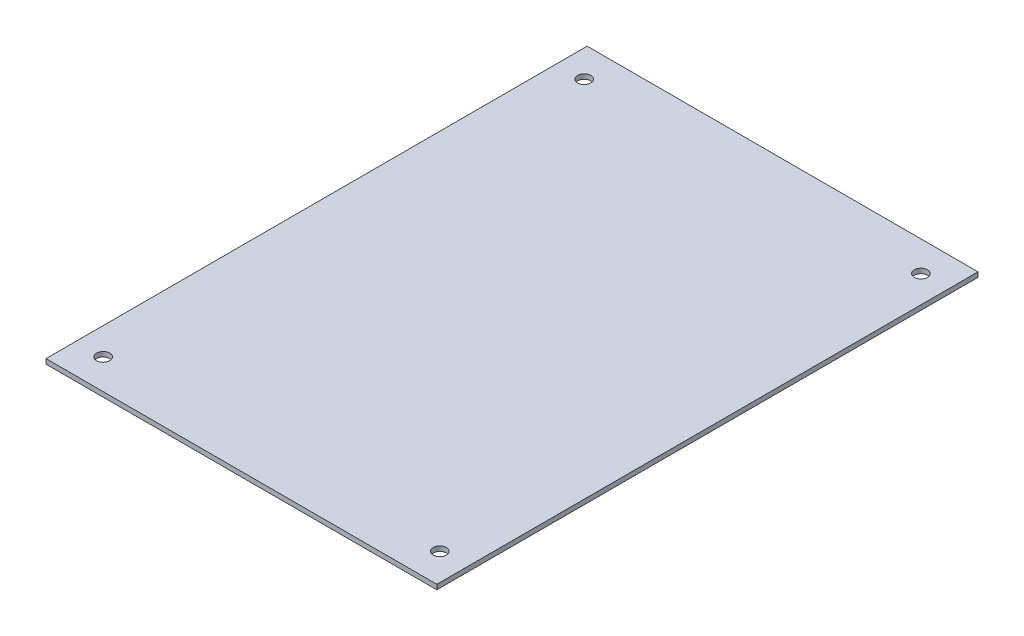
ISO-10303-21;
HEADER;
FILE_DESCRIPTION(('STEP AP214'),'2;1');
FILE_NAME('part.step','',(''),(''),'','','');
FILE_SCHEMA(('AUTOMOTIVE_DESIGN { 1 0 10303 214 1 1 1 1 }'));
ENDSEC;
DATA;
#1=APPLICATION_CONTEXT('core data for automotive mechanical design processes');
#2=APPLICATION_PROTOCOL_DEFINITION('international standard','automotive_design',2000,#1);
#3=PRODUCT_CONTEXT('',#1,'mechanical');
#4=PRODUCT('Part','Part','',(#3));
#5=PRODUCT_RELATED_PRODUCT_CATEGORY('part','',(#4));
#6=PRODUCT_DEFINITION_FORMATION('','',#4);
#7=PRODUCT_DEFINITION_CONTEXT('part definition',#1,'design');
#8=PRODUCT_DEFINITION('design','',#6,#7);
#9=PRODUCT_DEFINITION_SHAPE('','',#8);
#10=(LENGTH_UNIT() NAMED_UNIT(*) SI_UNIT(.MILLI.,.METRE.));
#11=(NAMED_UNIT(*) PLANE_ANGLE_UNIT() SI_UNIT($,.RADIAN.));
#12=(NAMED_UNIT(*) SI_UNIT($,.STERADIAN.) SOLID_ANGLE_UNIT());
#13=UNCERTAINTY_MEASURE_WITH_UNIT(LENGTH_MEASURE(1.E-05),#10,'distance_accuracy_value','');
#14=(GEOMETRIC_REPRESENTATION_CONTEXT(3) GLOBAL_UNCERTAINTY_ASSIGNED_CONTEXT((#13)) GLOBAL_UNIT_ASSIGNED_CONTEXT((#10,
#11,#12)) REPRESENTATION_CONTEXT('',''));
#15=CARTESIAN_POINT('',(0.,0.,0.));
#16=DIRECTION('',(0.,0.,1.));
#17=DIRECTION('',(1.,0.,0.));
#18=AXIS2_PLACEMENT_3D('',#15,#16,#17);
#19=CARTESIAN_POINT('',(0.,0.8,0.));
#20=DIRECTION('',(0.,0.,-1.));
#21=DIRECTION('',(-1.,0.,0.));
#22=AXIS2_PLACEMENT_3D('',#19,#20,#21);
#23=PLANE('',#22);
#24=DIRECTION('',(1.,0.,0.));
#25=VECTOR('',#24,1.);
#26=CARTESIAN_POINT('',(0.,0.,0.));
#27=LINE('',#26,#25);
#28=CARTESIAN_POINT('',(0.,0.,0.));
#29=VERTEX_POINT('',#28);
#30=CARTESIAN_POINT('',(65.,0.,0.));
#31=VERTEX_POINT('',#30);
#32=EDGE_CURVE('E127',#29,#31,#27,.T.);
#33=ORIENTED_EDGE('',*,*,#32,.T.);
#34=DIRECTION('',(0.,-1.,0.));
#35=VECTOR('',#34,1.);
#36=CARTESIAN_POINT('',(65.,0.8,0.));
#37=LINE('',#36,#35);
#38=CARTESIAN_POINT('',(65.,0.8,0.));
#39=VERTEX_POINT('',#38);
#40=EDGE_CURVE('E11',#39,#31,#37,.T.);
#41=ORIENTED_EDGE('',*,*,#40,.F.);
#42=DIRECTION('',(1.,0.,0.));
#43=VECTOR('',#42,1.);
#44=CARTESIAN_POINT('',(0.,0.8,0.));
#45=LINE('',#44,#43);
#46=CARTESIAN_POINT('',(0.,0.8,0.));
#47=VERTEX_POINT('',#46);
#48=EDGE_CURVE('E93',#47,#39,#45,.T.);
#49=ORIENTED_EDGE('',*,*,#48,.F.);
#50=DIRECTION('',(0.,-1.,0.));
#51=VECTOR('',#50,1.);
#52=CARTESIAN_POINT('',(0.,0.8,0.));
#53=LINE('',#52,#51);
#54=EDGE_CURVE('E59',#47,#29,#53,.T.);
#55=ORIENTED_EDGE('',*,*,#54,.T.);
#56=EDGE_LOOP('',(#33,#41,#49,#55));
#57=FACE_BOUND('',#56,.T.);
#58=ADVANCED_FACE('F41',(#57),#23,.F.);
#59=CARTESIAN_POINT('',(65.,0.8,0.));
#60=DIRECTION('',(-1.,0.,0.));
#61=DIRECTION('',(0.,0.,1.));
#62=AXIS2_PLACEMENT_3D('',#59,#60,#61);
#63=PLANE('',#62);
#64=DIRECTION('',(0.,0.,-1.));
#65=VECTOR('',#64,1.);
#66=CARTESIAN_POINT('',(65.,0.,0.));
#67=LINE('',#66,#65);
#68=CARTESIAN_POINT('',(65.,0.,-90.));
#69=VERTEX_POINT('',#68);
#70=EDGE_CURVE('E99',#31,#69,#67,.T.);
#71=ORIENTED_EDGE('',*,*,#70,.T.);
#72=DIRECTION('',(0.,-1.,0.));
#73=VECTOR('',#72,1.);
#74=CARTESIAN_POINT('',(65.,0.8,-90.));
#75=LINE('',#74,#73);
#76=CARTESIAN_POINT('',(65.,0.8,-90.));
#77=VERTEX_POINT('',#76);
#78=EDGE_CURVE('E51',#77,#69,#75,.T.);
#79=ORIENTED_EDGE('',*,*,#78,.F.);
#80=DIRECTION('',(0.,0.,-1.));
#81=VECTOR('',#80,1.);
#82=CARTESIAN_POINT('',(65.,0.8,0.));
#83=LINE('',#82,#81);
#84=EDGE_CURVE('E84',#39,#77,#83,.T.);
#85=ORIENTED_EDGE('',*,*,#84,.F.);
#86=ORIENTED_EDGE('',*,*,#40,.T.);
#87=EDGE_LOOP('',(#71,#79,#85,#86));
#88=FACE_BOUND('',#87,.T.);
#89=ADVANCED_FACE('F98',(#88),#63,.F.);
#90=CARTESIAN_POINT('',(0.,0.8,-90.));
#91=DIRECTION('',(0.,0.,-1.));
#92=DIRECTION('',(-1.,0.,0.));
#93=AXIS2_PLACEMENT_3D('',#90,#91,#92);
#94=PLANE('',#93);
#95=DIRECTION('',(1.,0.,0.));
#96=VECTOR('',#95,1.);
#97=CARTESIAN_POINT('',(0.,0.,-90.));
#98=LINE('',#97,#96);
#99=CARTESIAN_POINT('',(0.,0.,-90.));
#100=VERTEX_POINT('',#99);
#101=EDGE_CURVE('E132',#100,#69,#98,.T.);
#102=ORIENTED_EDGE('',*,*,#101,.F.);
#103=DIRECTION('',(0.,-1.,0.));
#104=VECTOR('',#103,1.);
#105=CARTESIAN_POINT('',(0.,0.8,-90.));
#106=LINE('',#105,#104);
#107=CARTESIAN_POINT('',(0.,0.8,-90.));
#108=VERTEX_POINT('',#107);
#109=EDGE_CURVE('E73',#108,#100,#106,.T.);
#110=ORIENTED_EDGE('',*,*,#109,.F.);
#111=DIRECTION('',(1.,0.,0.));
#112=VECTOR('',#111,1.);
#113=CARTESIAN_POINT('',(0.,0.8,-90.));
#114=LINE('',#113,#112);
#115=EDGE_CURVE('E92',#108,#77,#114,.T.);
#116=ORIENTED_EDGE('',*,*,#115,.T.);
#117=ORIENTED_EDGE('',*,*,#78,.T.);
#118=EDGE_LOOP('',(#102,#110,#116,#117));
#119=FACE_BOUND('',#118,.T.);
#120=ADVANCED_FACE('F103',(#119),#94,.T.);
#121=CARTESIAN_POINT('',(0.,0.8,0.));
#122=DIRECTION('',(-1.,0.,0.));
#123=DIRECTION('',(0.,0.,1.));
#124=AXIS2_PLACEMENT_3D('',#121,#122,#123);
#125=PLANE('',#124);
#126=DIRECTION('',(0.,0.,-1.));
#127=VECTOR('',#126,1.);
#128=CARTESIAN_POINT('',(0.,0.,0.));
#129=LINE('',#128,#127);
#130=EDGE_CURVE('E135',#29,#100,#129,.T.);
#131=ORIENTED_EDGE('',*,*,#130,.F.);
#132=ORIENTED_EDGE('',*,*,#54,.F.);
#133=DIRECTION('',(0.,0.,-1.));
#134=VECTOR('',#133,1.);
#135=CARTESIAN_POINT('',(0.,0.8,0.));
#136=LINE('',#135,#134);
#137=EDGE_CURVE('E105',#47,#108,#136,.T.);
#138=ORIENTED_EDGE('',*,*,#137,.T.);
#139=ORIENTED_EDGE('',*,*,#109,.T.);
#140=EDGE_LOOP('',(#131,#132,#138,#139));
#141=FACE_BOUND('',#140,.T.);
#142=ADVANCED_FACE('F192',(#141),#125,.T.);
#143=CARTESIAN_POINT('',(4.5,0.8,-5.));
#144=DIRECTION('',(0.,-1.,0.));
#145=DIRECTION('',(0.,0.,-1.));
#146=AXIS2_PLACEMENT_3D('',#143,#144,#145);
#147=CYLINDRICAL_SURFACE('',#146,1.1);
#148=CARTESIAN_POINT('',(4.5,0.8,-5.));
#149=DIRECTION('',(0.,1.,0.));
#150=DIRECTION('',(0.,0.,1.));
#151=AXIS2_PLACEMENT_3D('',#148,#149,#150);
#152=CIRCLE('',#151,1.1);
#153=CARTESIAN_POINT('',(4.5,0.8,-3.9));
#154=VERTEX_POINT('',#153);
#155=EDGE_CURVE('E157',#154,#154,#152,.T.);
#156=ORIENTED_EDGE('',*,*,#155,.T.);
#157=EDGE_LOOP('',(#156));
#158=FACE_BOUND('',#157,.T.);
#159=CARTESIAN_POINT('',(4.5,0.,-5.));
#160=DIRECTION('',(0.,1.,0.));
#161=DIRECTION('',(0.,0.,1.));
#162=AXIS2_PLACEMENT_3D('',#159,#160,#161);
#163=CIRCLE('',#162,1.1);
#164=CARTESIAN_POINT('',(4.5,0.,-3.9));
#165=VERTEX_POINT('',#164);
#166=EDGE_CURVE('E123',#165,#165,#163,.T.);
#167=ORIENTED_EDGE('',*,*,#166,.F.);
#168=EDGE_LOOP('',(#167));
#169=FACE_BOUND('',#168,.T.);
#170=ADVANCED_FACE('F165',(#158,#169),#147,.F.);
#171=CARTESIAN_POINT('',(4.49999999999999,0.8,-85.));
#172=DIRECTION('',(0.,-1.,0.));
#173=DIRECTION('',(0.,0.,-1.));
#174=AXIS2_PLACEMENT_3D('',#171,#172,#173);
#175=CYLINDRICAL_SURFACE('',#174,1.1);
#176=CARTESIAN_POINT('',(4.49999999999999,0.8,-85.));
#177=DIRECTION('',(0.,1.,0.));
#178=DIRECTION('',(0.,0.,1.));
#179=AXIS2_PLACEMENT_3D('',#176,#177,#178);
#180=CIRCLE('',#179,1.1);
#181=CARTESIAN_POINT('',(4.49999999999999,0.8,-83.9));
#182=VERTEX_POINT('',#181);
#183=EDGE_CURVE('E151',#182,#182,#180,.F.);
#184=ORIENTED_EDGE('',*,*,#183,.F.);
#185=EDGE_LOOP('',(#184));
#186=FACE_BOUND('',#185,.T.);
#187=CARTESIAN_POINT('',(4.49999999999999,0.,-85.));
#188=DIRECTION('',(0.,1.,0.));
#189=DIRECTION('',(0.,0.,1.));
#190=AXIS2_PLACEMENT_3D('',#187,#188,#189);
#191=CIRCLE('',#190,1.1);
#192=CARTESIAN_POINT('',(4.49999999999999,0.,-83.9));
#193=VERTEX_POINT('',#192);
#194=EDGE_CURVE('E119',#193,#193,#191,.F.);
#195=ORIENTED_EDGE('',*,*,#194,.T.);
#196=EDGE_LOOP('',(#195));
#197=FACE_BOUND('',#196,.T.);
#198=ADVANCED_FACE('F191',(#186,#197),#175,.F.);
#199=CARTESIAN_POINT('',(60.5,0.8,-85.));
#200=DIRECTION('',(0.,-1.,0.));
#201=DIRECTION('',(0.,0.,-1.));
#202=AXIS2_PLACEMENT_3D('',#199,#200,#201);
#203=CYLINDRICAL_SURFACE('',#202,1.1);
#204=CARTESIAN_POINT('',(60.5,0.8,-85.));
#205=DIRECTION('',(0.,1.,0.));
#206=DIRECTION('',(0.,0.,1.));
#207=AXIS2_PLACEMENT_3D('',#204,#205,#206);
#208=CIRCLE('',#207,1.1);
#209=CARTESIAN_POINT('',(60.5,0.8,-83.9));
#210=VERTEX_POINT('',#209);
#211=EDGE_CURVE('E143',#210,#210,#208,.T.);
#212=ORIENTED_EDGE('',*,*,#211,.T.);
#213=EDGE_LOOP('',(#212));
#214=FACE_BOUND('',#213,.T.);
#215=CARTESIAN_POINT('',(60.5,0.,-85.));
#216=DIRECTION('',(0.,1.,0.));
#217=DIRECTION('',(0.,0.,1.));
#218=AXIS2_PLACEMENT_3D('',#215,#216,#217);
#219=CIRCLE('',#218,1.1);
#220=CARTESIAN_POINT('',(60.5,0.,-83.9));
#221=VERTEX_POINT('',#220);
#222=EDGE_CURVE('E115',#221,#221,#219,.T.);
#223=ORIENTED_EDGE('',*,*,#222,.F.);
#224=EDGE_LOOP('',(#223));
#225=FACE_BOUND('',#224,.T.);
#226=ADVANCED_FACE('F43',(#214,#225),#203,.F.);
#227=CARTESIAN_POINT('',(60.5,0.8,-5.00000000000001));
#228=DIRECTION('',(0.,-1.,0.));
#229=DIRECTION('',(0.,0.,-1.));
#230=AXIS2_PLACEMENT_3D('',#227,#228,#229);
#231=CYLINDRICAL_SURFACE('',#230,1.1);
#232=CARTESIAN_POINT('',(60.5,0.8,-5.00000000000001));
#233=DIRECTION('',(0.,1.,0.));
#234=DIRECTION('',(0.,0.,1.));
#235=AXIS2_PLACEMENT_3D('',#232,#233,#234);
#236=CIRCLE('',#235,1.1);
#237=CARTESIAN_POINT('',(60.5,0.8,-3.90000000000001));
#238=VERTEX_POINT('',#237);
#239=EDGE_CURVE('E108',#238,#238,#236,.F.);
#240=ORIENTED_EDGE('',*,*,#239,.F.);
#241=EDGE_LOOP('',(#240));
#242=FACE_BOUND('',#241,.T.);
#243=CARTESIAN_POINT('',(60.5,0.,-5.00000000000001));
#244=DIRECTION('',(0.,1.,0.));
#245=DIRECTION('',(0.,0.,1.));
#246=AXIS2_PLACEMENT_3D('',#243,#244,#245);
#247=CIRCLE('',#246,1.1);
#248=CARTESIAN_POINT('',(60.5,0.,-3.90000000000001));
#249=VERTEX_POINT('',#248);
#250=EDGE_CURVE('E139',#249,#249,#247,.F.);
#251=ORIENTED_EDGE('',*,*,#250,.T.);
#252=EDGE_LOOP('',(#251));
#253=FACE_BOUND('',#252,.T.);
#254=ADVANCED_FACE('F170',(#242,#253),#231,.F.);
#255=CARTESIAN_POINT('',(0.,0.8,0.));
#256=DIRECTION('',(0.,1.,0.));
#257=DIRECTION('',(0.,0.,1.));
#258=AXIS2_PLACEMENT_3D('',#255,#256,#257);
#259=PLANE('',#258);
#260=ORIENTED_EDGE('',*,*,#211,.F.);
#261=EDGE_LOOP('',(#260));
#262=FACE_BOUND('',#261,.T.);
#263=ORIENTED_EDGE('',*,*,#183,.T.);
#264=EDGE_LOOP('',(#263));
#265=FACE_BOUND('',#264,.T.);
#266=ORIENTED_EDGE('',*,*,#155,.F.);
#267=EDGE_LOOP('',(#266));
#268=FACE_BOUND('',#267,.T.);
#269=ORIENTED_EDGE('',*,*,#48,.T.);
#270=ORIENTED_EDGE('',*,*,#84,.T.);
#271=ORIENTED_EDGE('',*,*,#115,.F.);
#272=ORIENTED_EDGE('',*,*,#137,.F.);
#273=EDGE_LOOP('',(#269,#270,#271,#272));
#274=FACE_BOUND('',#273,.T.);
#275=ORIENTED_EDGE('',*,*,#239,.T.);
#276=EDGE_LOOP('',(#275));
#277=FACE_BOUND('',#276,.T.);
#278=ADVANCED_FACE('F88',(#262,#265,#268,#274,#277),#259,.T.);
#279=CARTESIAN_POINT('',(0.,0.,0.));
#280=DIRECTION('',(0.,1.,0.));
#281=DIRECTION('',(0.,0.,1.));
#282=AXIS2_PLACEMENT_3D('',#279,#280,#281);
#283=PLANE('',#282);
#284=ORIENTED_EDGE('',*,*,#222,.T.);
#285=EDGE_LOOP('',(#284));
#286=FACE_BOUND('',#285,.T.);
#287=ORIENTED_EDGE('',*,*,#194,.F.);
#288=EDGE_LOOP('',(#287));
#289=FACE_BOUND('',#288,.T.);
#290=ORIENTED_EDGE('',*,*,#166,.T.);
#291=EDGE_LOOP('',(#290));
#292=FACE_BOUND('',#291,.T.);
#293=ORIENTED_EDGE('',*,*,#32,.F.);
#294=ORIENTED_EDGE('',*,*,#130,.T.);
#295=ORIENTED_EDGE('',*,*,#101,.T.);
#296=ORIENTED_EDGE('',*,*,#70,.F.);
#297=EDGE_LOOP('',(#293,#294,#295,#296));
#298=FACE_BOUND('',#297,.T.);
#299=ORIENTED_EDGE('',*,*,#250,.F.);
#300=EDGE_LOOP('',(#299));
#301=FACE_BOUND('',#300,.T.);
#302=ADVANCED_FACE('F169',(#286,#289,#292,#298,#301),#283,.F.);
#303=CLOSED_SHELL('',(#58,#89,#120,#142,#170,#198,#226,#254,#278,#302));
#304=MANIFOLD_SOLID_BREP('B2',#303);
#305=ADVANCED_BREP_SHAPE_REPRESENTATION('',(#18,#304),#14);
#306=SHAPE_DEFINITION_REPRESENTATION(#9,#305);
ENDSEC;
END-ISO-10303-21;
